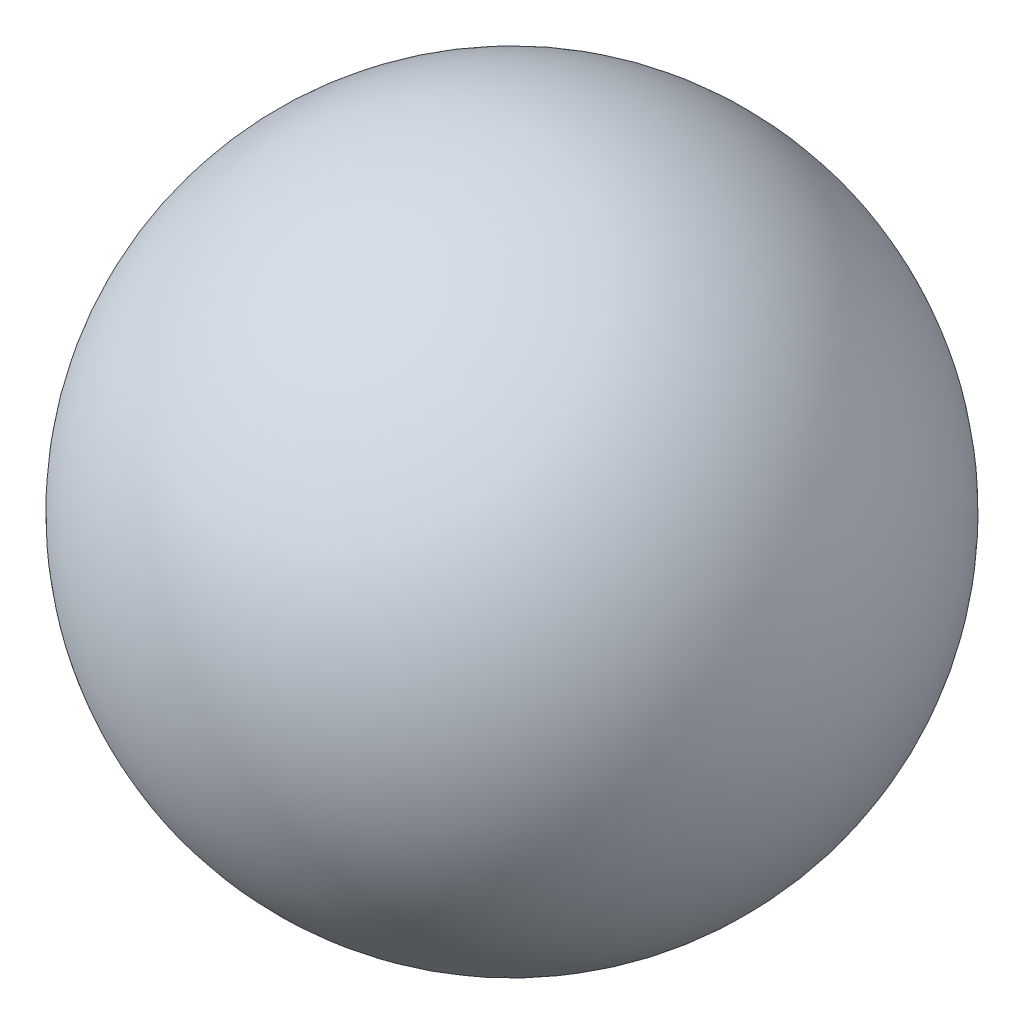
ISO-10303-21;
HEADER;
FILE_DESCRIPTION(('STEP AP214'),'2;1');
FILE_NAME('part.step','',(''),(''),'','','');
FILE_SCHEMA(('AUTOMOTIVE_DESIGN { 1 0 10303 214 1 1 1 1 }'));
ENDSEC;
DATA;
#1=APPLICATION_CONTEXT('core data for automotive mechanical design processes');
#2=APPLICATION_PROTOCOL_DEFINITION('international standard','automotive_design',2000,#1);
#3=PRODUCT_CONTEXT('',#1,'mechanical');
#4=PRODUCT('Part','Part','',(#3));
#5=PRODUCT_RELATED_PRODUCT_CATEGORY('part','',(#4));
#6=PRODUCT_DEFINITION_FORMATION('','',#4);
#7=PRODUCT_DEFINITION_CONTEXT('part definition',#1,'design');
#8=PRODUCT_DEFINITION('design','',#6,#7);
#9=PRODUCT_DEFINITION_SHAPE('','',#8);
#10=(LENGTH_UNIT() NAMED_UNIT(*) SI_UNIT(.MILLI.,.METRE.));
#11=(NAMED_UNIT(*) PLANE_ANGLE_UNIT() SI_UNIT($,.RADIAN.));
#12=(NAMED_UNIT(*) SI_UNIT($,.STERADIAN.) SOLID_ANGLE_UNIT());
#13=UNCERTAINTY_MEASURE_WITH_UNIT(LENGTH_MEASURE(1.E-05),#10,'distance_accuracy_value','');
#14=(GEOMETRIC_REPRESENTATION_CONTEXT(3) GLOBAL_UNCERTAINTY_ASSIGNED_CONTEXT((#13)) GLOBAL_UNIT_ASSIGNED_CONTEXT((#10,
#11,#12)) REPRESENTATION_CONTEXT('',''));
#15=CARTESIAN_POINT('',(0.,0.,0.));
#16=DIRECTION('',(0.,0.,1.));
#17=DIRECTION('',(1.,0.,0.));
#18=AXIS2_PLACEMENT_3D('',#15,#16,#17);
#19=CARTESIAN_POINT('',(0.,0.,0.));
#20=DIRECTION('',(0.,0.,-1.));
#21=DIRECTION('',(1.,0.,0.));
#22=AXIS2_PLACEMENT_3D('',#19,#20,#21);
#23=SPHERICAL_SURFACE('',#22,38.1);
#24=CARTESIAN_POINT('',(0.,0.,-38.1));
#25=VERTEX_POINT('',#24);
#26=VERTEX_LOOP('',#25);
#27=FACE_BOUND('',#26,.T.);
#28=ADVANCED_FACE('F32',(#27),#23,.T.);
#29=CLOSED_SHELL('',(#28));
#30=MANIFOLD_SOLID_BREP('B2',#29);
#31=ADVANCED_BREP_SHAPE_REPRESENTATION('',(#18,#30),#14);
#32=SHAPE_DEFINITION_REPRESENTATION(#9,#31);
ENDSEC;
END-ISO-10303-21;
